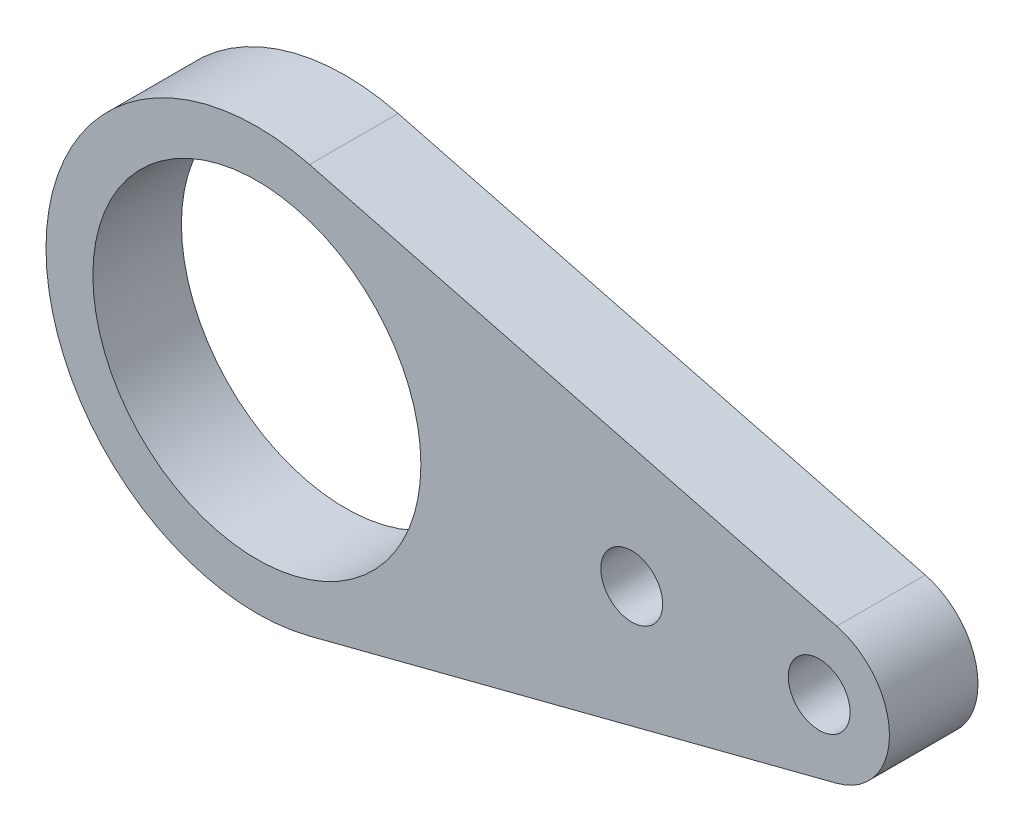
ISO-10303-21;
HEADER;
FILE_DESCRIPTION(('STEP AP214'),'2;1');
FILE_NAME('part.step','',(''),(''),'','','');
FILE_SCHEMA(('AUTOMOTIVE_DESIGN { 1 0 10303 214 1 1 1 1 }'));
ENDSEC;
DATA;
#1=APPLICATION_CONTEXT('core data for automotive mechanical design processes');
#2=APPLICATION_PROTOCOL_DEFINITION('international standard','automotive_design',2000,#1);
#3=PRODUCT_CONTEXT('',#1,'mechanical');
#4=PRODUCT('Part','Part','',(#3));
#5=PRODUCT_RELATED_PRODUCT_CATEGORY('part','',(#4));
#6=PRODUCT_DEFINITION_FORMATION('','',#4);
#7=PRODUCT_DEFINITION_CONTEXT('part definition',#1,'design');
#8=PRODUCT_DEFINITION('design','',#6,#7);
#9=PRODUCT_DEFINITION_SHAPE('','',#8);
#10=(LENGTH_UNIT() NAMED_UNIT(*) SI_UNIT(.MILLI.,.METRE.));
#11=(NAMED_UNIT(*) PLANE_ANGLE_UNIT() SI_UNIT($,.RADIAN.));
#12=(NAMED_UNIT(*) SI_UNIT($,.STERADIAN.) SOLID_ANGLE_UNIT());
#13=UNCERTAINTY_MEASURE_WITH_UNIT(LENGTH_MEASURE(1.E-05),#10,'distance_accuracy_value','');
#14=(GEOMETRIC_REPRESENTATION_CONTEXT(3) GLOBAL_UNCERTAINTY_ASSIGNED_CONTEXT((#13)) GLOBAL_UNIT_ASSIGNED_CONTEXT((#10,
#11,#12)) REPRESENTATION_CONTEXT('',''));
#15=CARTESIAN_POINT('',(0.,0.,0.));
#16=DIRECTION('',(0.,0.,1.));
#17=DIRECTION('',(1.,0.,0.));
#18=AXIS2_PLACEMENT_3D('',#15,#16,#17);
#19=CARTESIAN_POINT('',(0.,0.,3.));
#20=DIRECTION('',(0.,0.,1.));
#21=DIRECTION('',(1.,0.,0.));
#22=AXIS2_PLACEMENT_3D('',#19,#20,#21);
#23=PLANE('',#22);
#24=CARTESIAN_POINT('',(0.,0.,3.));
#25=DIRECTION('',(0.,0.,-1.));
#26=DIRECTION('',(-1.,0.,0.));
#27=AXIS2_PLACEMENT_3D('',#24,#25,#26);
#28=CIRCLE('',#27,11.1125);
#29=CARTESIAN_POINT('',(-11.1125,0.,3.));
#30=VERTEX_POINT('',#29);
#31=EDGE_CURVE('E97',#30,#30,#28,.T.);
#32=ORIENTED_EDGE('',*,*,#31,.T.);
#33=EDGE_LOOP('',(#32));
#34=FACE_BOUND('',#33,.T.);
#35=DIRECTION('',(0.968245836551854,0.25,0.));
#36=VECTOR('',#35,1.);
#37=CARTESIAN_POINT('',(3.571875,-13.8338123897346,3.));
#38=LINE('',#37,#36);
#39=CARTESIAN_POINT('',(39.290625,-4.61127079657821,3.));
#40=VERTEX_POINT('',#39);
#41=CARTESIAN_POINT('',(3.571875,-13.8338123897346,3.));
#42=VERTEX_POINT('',#41);
#43=EDGE_CURVE('E55',#40,#42,#38,.F.);
#44=ORIENTED_EDGE('',*,*,#43,.F.);
#45=CARTESIAN_POINT('',(38.1,0.,3.));
#46=DIRECTION('',(0.,0.,-1.));
#47=DIRECTION('',(-1.,0.,0.));
#48=AXIS2_PLACEMENT_3D('',#45,#46,#47);
#49=CIRCLE('',#48,4.7625);
#50=CARTESIAN_POINT('',(39.290625,4.61127079657821,3.));
#51=VERTEX_POINT('',#50);
#52=EDGE_CURVE('E78',#51,#40,#49,.T.);
#53=ORIENTED_EDGE('',*,*,#52,.F.);
#54=DIRECTION('',(-0.968245836551854,0.25,0.));
#55=VECTOR('',#54,1.);
#56=CARTESIAN_POINT('',(3.571875,13.8338123897346,3.));
#57=LINE('',#56,#55);
#58=CARTESIAN_POINT('',(3.571875,13.8338123897346,3.));
#59=VERTEX_POINT('',#58);
#60=EDGE_CURVE('E70',#59,#51,#57,.F.);
#61=ORIENTED_EDGE('',*,*,#60,.F.);
#62=CARTESIAN_POINT('',(0.,0.,3.));
#63=DIRECTION('',(0.,0.,-1.));
#64=DIRECTION('',(-1.,0.,0.));
#65=AXIS2_PLACEMENT_3D('',#62,#63,#64);
#66=CIRCLE('',#65,14.2875);
#67=EDGE_CURVE('E65',#42,#59,#66,.T.);
#68=ORIENTED_EDGE('',*,*,#67,.F.);
#69=EDGE_LOOP('',(#44,#53,#61,#68));
#70=FACE_BOUND('',#69,.T.);
#71=CARTESIAN_POINT('',(38.1,0.,3.));
#72=DIRECTION('',(0.,0.,1.));
#73=DIRECTION('',(1.,0.,0.));
#74=AXIS2_PLACEMENT_3D('',#71,#72,#73);
#75=CIRCLE('',#74,2.0955);
#76=CARTESIAN_POINT('',(40.1955,0.,3.));
#77=VERTEX_POINT('',#76);
#78=EDGE_CURVE('E74',#77,#77,#75,.F.);
#79=ORIENTED_EDGE('',*,*,#78,.T.);
#80=EDGE_LOOP('',(#79));
#81=FACE_BOUND('',#80,.T.);
#82=CARTESIAN_POINT('',(25.4,0.,3.));
#83=DIRECTION('',(0.,0.,1.));
#84=DIRECTION('',(1.,0.,0.));
#85=AXIS2_PLACEMENT_3D('',#82,#83,#84);
#86=CIRCLE('',#85,2.0955);
#87=CARTESIAN_POINT('',(27.4955,0.,3.));
#88=VERTEX_POINT('',#87);
#89=EDGE_CURVE('E19',#88,#88,#86,.F.);
#90=ORIENTED_EDGE('',*,*,#89,.T.);
#91=EDGE_LOOP('',(#90));
#92=FACE_BOUND('',#91,.T.);
#93=ADVANCED_FACE('F16',(#34,#70,#81,#92),#23,.T.);
#94=CARTESIAN_POINT('',(25.4,0.,3.));
#95=DIRECTION('',(0.,0.,1.));
#96=DIRECTION('',(1.,0.,0.));
#97=AXIS2_PLACEMENT_3D('',#94,#95,#96);
#98=CYLINDRICAL_SURFACE('',#97,2.0955);
#99=CARTESIAN_POINT('',(25.4,0.,-3.));
#100=DIRECTION('',(0.,0.,1.));
#101=DIRECTION('',(1.,0.,0.));
#102=AXIS2_PLACEMENT_3D('',#99,#100,#101);
#103=CIRCLE('',#102,2.0955);
#104=CARTESIAN_POINT('',(27.4955,0.,-3.));
#105=VERTEX_POINT('',#104);
#106=EDGE_CURVE('E94',#105,#105,#103,.F.);
#107=ORIENTED_EDGE('',*,*,#106,.T.);
#108=EDGE_LOOP('',(#107));
#109=FACE_BOUND('',#108,.T.);
#110=ORIENTED_EDGE('',*,*,#89,.F.);
#111=EDGE_LOOP('',(#110));
#112=FACE_BOUND('',#111,.T.);
#113=ADVANCED_FACE('F105',(#109,#112),#98,.F.);
#114=CARTESIAN_POINT('',(38.1,0.,3.));
#115=DIRECTION('',(0.,0.,1.));
#116=DIRECTION('',(1.,0.,0.));
#117=AXIS2_PLACEMENT_3D('',#114,#115,#116);
#118=CYLINDRICAL_SURFACE('',#117,2.0955);
#119=CARTESIAN_POINT('',(38.1,0.,-3.));
#120=DIRECTION('',(0.,0.,1.));
#121=DIRECTION('',(1.,0.,0.));
#122=AXIS2_PLACEMENT_3D('',#119,#120,#121);
#123=CIRCLE('',#122,2.0955);
#124=CARTESIAN_POINT('',(40.1955,0.,-3.));
#125=VERTEX_POINT('',#124);
#126=EDGE_CURVE('E91',#125,#125,#123,.F.);
#127=ORIENTED_EDGE('',*,*,#126,.T.);
#128=EDGE_LOOP('',(#127));
#129=FACE_BOUND('',#128,.T.);
#130=ORIENTED_EDGE('',*,*,#78,.F.);
#131=EDGE_LOOP('',(#130));
#132=FACE_BOUND('',#131,.T.);
#133=ADVANCED_FACE('F107',(#129,#132),#118,.F.);
#134=CARTESIAN_POINT('',(0.,0.,3.));
#135=DIRECTION('',(0.,0.,-1.));
#136=DIRECTION('',(-1.,0.,0.));
#137=AXIS2_PLACEMENT_3D('',#134,#135,#136);
#138=CYLINDRICAL_SURFACE('',#137,14.2875);
#139=CARTESIAN_POINT('',(0.,0.,-3.));
#140=DIRECTION('',(0.,0.,-1.));
#141=DIRECTION('',(-1.,0.,0.));
#142=AXIS2_PLACEMENT_3D('',#139,#140,#141);
#143=CIRCLE('',#142,14.2875);
#144=CARTESIAN_POINT('',(3.571875,13.8338123897346,-3.));
#145=VERTEX_POINT('',#144);
#146=CARTESIAN_POINT('',(3.571875,-13.8338123897346,-3.));
#147=VERTEX_POINT('',#146);
#148=EDGE_CURVE('E77',#145,#147,#143,.F.);
#149=ORIENTED_EDGE('',*,*,#148,.T.);
#150=DIRECTION('',(0.,0.,1.));
#151=VECTOR('',#150,1.);
#152=CARTESIAN_POINT('',(3.571875,-13.8338123897346,3.));
#153=LINE('',#152,#151);
#154=EDGE_CURVE('E60',#42,#147,#153,.F.);
#155=ORIENTED_EDGE('',*,*,#154,.F.);
#156=ORIENTED_EDGE('',*,*,#67,.T.);
#157=DIRECTION('',(0.,0.,1.));
#158=VECTOR('',#157,1.);
#159=CARTESIAN_POINT('',(3.571875,13.8338123897346,3.));
#160=LINE('',#159,#158);
#161=EDGE_CURVE('E84',#145,#59,#160,.T.);
#162=ORIENTED_EDGE('',*,*,#161,.F.);
#163=EDGE_LOOP('',(#149,#155,#156,#162));
#164=FACE_BOUND('',#163,.T.);
#165=ADVANCED_FACE('F76',(#164),#138,.T.);
#166=CARTESIAN_POINT('',(3.571875,-13.8338123897346,3.));
#167=DIRECTION('',(0.25,-0.968245836551854,0.));
#168=DIRECTION('',(0.968245836551854,0.25,0.));
#169=AXIS2_PLACEMENT_3D('',#166,#167,#168);
#170=PLANE('',#169);
#171=ORIENTED_EDGE('',*,*,#43,.T.);
#172=ORIENTED_EDGE('',*,*,#154,.T.);
#173=DIRECTION('',(0.968245836551854,0.25,0.));
#174=VECTOR('',#173,1.);
#175=CARTESIAN_POINT('',(3.571875,-13.8338123897346,-3.));
#176=LINE('',#175,#174);
#177=CARTESIAN_POINT('',(39.290625,-4.61127079657821,-3.));
#178=VERTEX_POINT('',#177);
#179=EDGE_CURVE('E89',#147,#178,#176,.T.);
#180=ORIENTED_EDGE('',*,*,#179,.T.);
#181=DIRECTION('',(0.,0.,-1.));
#182=VECTOR('',#181,1.);
#183=CARTESIAN_POINT('',(39.290625,-4.61127079657821,3.));
#184=LINE('',#183,#182);
#185=EDGE_CURVE('E62',#40,#178,#184,.T.);
#186=ORIENTED_EDGE('',*,*,#185,.F.);
#187=EDGE_LOOP('',(#171,#172,#180,#186));
#188=FACE_BOUND('',#187,.T.);
#189=ADVANCED_FACE('F57',(#188),#170,.T.);
#190=CARTESIAN_POINT('',(38.1,0.,3.));
#191=DIRECTION('',(0.,0.,-1.));
#192=DIRECTION('',(-1.,0.,0.));
#193=AXIS2_PLACEMENT_3D('',#190,#191,#192);
#194=CYLINDRICAL_SURFACE('',#193,4.7625);
#195=ORIENTED_EDGE('',*,*,#52,.T.);
#196=ORIENTED_EDGE('',*,*,#185,.T.);
#197=CARTESIAN_POINT('',(38.1,0.,-3.));
#198=DIRECTION('',(0.,0.,-1.));
#199=DIRECTION('',(-1.,0.,0.));
#200=AXIS2_PLACEMENT_3D('',#197,#198,#199);
#201=CIRCLE('',#200,4.7625);
#202=CARTESIAN_POINT('',(39.290625,4.61127079657821,-3.));
#203=VERTEX_POINT('',#202);
#204=EDGE_CURVE('E86',#178,#203,#201,.F.);
#205=ORIENTED_EDGE('',*,*,#204,.T.);
#206=DIRECTION('',(0.,0.,1.));
#207=VECTOR('',#206,1.);
#208=CARTESIAN_POINT('',(39.290625,4.61127079657821,3.));
#209=LINE('',#208,#207);
#210=EDGE_CURVE('E34',#51,#203,#209,.F.);
#211=ORIENTED_EDGE('',*,*,#210,.F.);
#212=EDGE_LOOP('',(#195,#196,#205,#211));
#213=FACE_BOUND('',#212,.T.);
#214=ADVANCED_FACE('F133',(#213),#194,.T.);
#215=CARTESIAN_POINT('',(3.571875,13.8338123897346,3.));
#216=DIRECTION('',(0.25,0.968245836551854,0.));
#217=DIRECTION('',(-0.968245836551854,0.25,0.));
#218=AXIS2_PLACEMENT_3D('',#215,#216,#217);
#219=PLANE('',#218);
#220=ORIENTED_EDGE('',*,*,#60,.T.);
#221=ORIENTED_EDGE('',*,*,#210,.T.);
#222=DIRECTION('',(-0.968245836551854,0.25,0.));
#223=VECTOR('',#222,1.);
#224=CARTESIAN_POINT('',(39.290625,4.61127079657821,-3.));
#225=LINE('',#224,#223);
#226=EDGE_CURVE('E25',#203,#145,#225,.T.);
#227=ORIENTED_EDGE('',*,*,#226,.T.);
#228=ORIENTED_EDGE('',*,*,#161,.T.);
#229=EDGE_LOOP('',(#220,#221,#227,#228));
#230=FACE_BOUND('',#229,.T.);
#231=ADVANCED_FACE('F125',(#230),#219,.T.);
#232=CARTESIAN_POINT('',(0.,0.,3.));
#233=DIRECTION('',(0.,0.,-1.));
#234=DIRECTION('',(-1.,0.,0.));
#235=AXIS2_PLACEMENT_3D('',#232,#233,#234);
#236=CYLINDRICAL_SURFACE('',#235,11.1125);
#237=CARTESIAN_POINT('',(0.,0.,-3.));
#238=DIRECTION('',(0.,0.,-1.));
#239=DIRECTION('',(-1.,0.,0.));
#240=AXIS2_PLACEMENT_3D('',#237,#238,#239);
#241=CIRCLE('',#240,11.1125);
#242=CARTESIAN_POINT('',(-11.1125,0.,-3.));
#243=VERTEX_POINT('',#242);
#244=EDGE_CURVE('E9',#243,#243,#241,.T.);
#245=ORIENTED_EDGE('',*,*,#244,.T.);
#246=EDGE_LOOP('',(#245));
#247=FACE_BOUND('',#246,.T.);
#248=ORIENTED_EDGE('',*,*,#31,.F.);
#249=EDGE_LOOP('',(#248));
#250=FACE_BOUND('',#249,.T.);
#251=ADVANCED_FACE('F119',(#247,#250),#236,.F.);
#252=CARTESIAN_POINT('',(0.,0.,-3.));
#253=DIRECTION('',(0.,0.,1.));
#254=DIRECTION('',(1.,0.,0.));
#255=AXIS2_PLACEMENT_3D('',#252,#253,#254);
#256=PLANE('',#255);
#257=ORIENTED_EDGE('',*,*,#244,.F.);
#258=EDGE_LOOP('',(#257));
#259=FACE_BOUND('',#258,.T.);
#260=ORIENTED_EDGE('',*,*,#204,.F.);
#261=ORIENTED_EDGE('',*,*,#179,.F.);
#262=ORIENTED_EDGE('',*,*,#148,.F.);
#263=ORIENTED_EDGE('',*,*,#226,.F.);
#264=EDGE_LOOP('',(#260,#261,#262,#263));
#265=FACE_BOUND('',#264,.T.);
#266=ORIENTED_EDGE('',*,*,#126,.F.);
#267=EDGE_LOOP('',(#266));
#268=FACE_BOUND('',#267,.T.);
#269=ORIENTED_EDGE('',*,*,#106,.F.);
#270=EDGE_LOOP('',(#269));
#271=FACE_BOUND('',#270,.T.);
#272=ADVANCED_FACE('F117',(#259,#265,#268,#271),#256,.F.);
#273=CLOSED_SHELL('',(#93,#113,#133,#165,#189,#214,#231,#251,#272));
#274=MANIFOLD_SOLID_BREP('B1',#273);
#275=ADVANCED_BREP_SHAPE_REPRESENTATION('',(#18,#274),#14);
#276=SHAPE_DEFINITION_REPRESENTATION(#9,#275);
ENDSEC;
END-ISO-10303-21;
